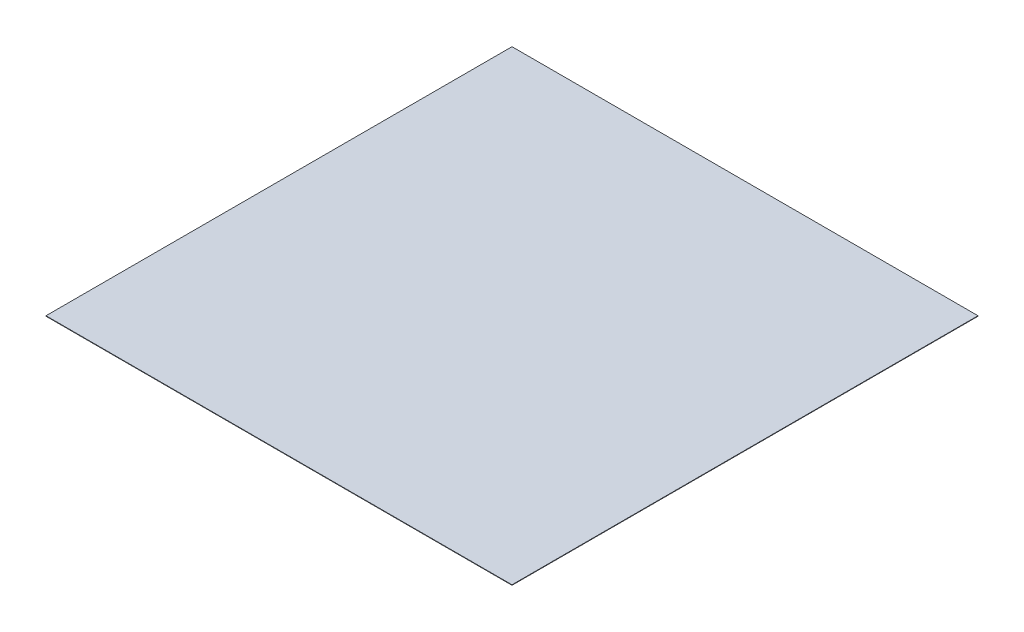
ISO-10303-21;
HEADER;
FILE_DESCRIPTION(('STEP AP214'),'2;1');
FILE_NAME('part.step','',(''),(''),'','','');
FILE_SCHEMA(('AUTOMOTIVE_DESIGN { 1 0 10303 214 1 1 1 1 }'));
ENDSEC;
DATA;
#1=APPLICATION_CONTEXT('core data for automotive mechanical design processes');
#2=APPLICATION_PROTOCOL_DEFINITION('international standard','automotive_design',2000,#1);
#3=PRODUCT_CONTEXT('',#1,'mechanical');
#4=PRODUCT('Part','Part','',(#3));
#5=PRODUCT_RELATED_PRODUCT_CATEGORY('part','',(#4));
#6=PRODUCT_DEFINITION_FORMATION('','',#4);
#7=PRODUCT_DEFINITION_CONTEXT('part definition',#1,'design');
#8=PRODUCT_DEFINITION('design','',#6,#7);
#9=PRODUCT_DEFINITION_SHAPE('','',#8);
#10=(LENGTH_UNIT() NAMED_UNIT(*) SI_UNIT(.MILLI.,.METRE.));
#11=(NAMED_UNIT(*) PLANE_ANGLE_UNIT() SI_UNIT($,.RADIAN.));
#12=(NAMED_UNIT(*) SI_UNIT($,.STERADIAN.) SOLID_ANGLE_UNIT());
#13=UNCERTAINTY_MEASURE_WITH_UNIT(LENGTH_MEASURE(1.E-05),#10,'distance_accuracy_value','');
#14=(GEOMETRIC_REPRESENTATION_CONTEXT(3) GLOBAL_UNCERTAINTY_ASSIGNED_CONTEXT((#13)) GLOBAL_UNIT_ASSIGNED_CONTEXT((#10,
#11,#12)) REPRESENTATION_CONTEXT('',''));
#15=CARTESIAN_POINT('',(0.,0.,0.));
#16=DIRECTION('',(0.,0.,1.));
#17=DIRECTION('',(1.,0.,0.));
#18=AXIS2_PLACEMENT_3D('',#15,#16,#17);
#19=CARTESIAN_POINT('',(500.,1.,500.));
#20=DIRECTION('',(-1.,0.,0.));
#21=DIRECTION('',(0.,0.,1.));
#22=AXIS2_PLACEMENT_3D('',#19,#20,#21);
#23=PLANE('',#22);
#24=DIRECTION('',(0.,0.,-1.));
#25=VECTOR('',#24,1.);
#26=CARTESIAN_POINT('',(500.,0.,500.));
#27=LINE('',#26,#25);
#28=CARTESIAN_POINT('',(500.,0.,500.));
#29=VERTEX_POINT('',#28);
#30=CARTESIAN_POINT('',(500.,0.,-500.));
#31=VERTEX_POINT('',#30);
#32=EDGE_CURVE('E98',#29,#31,#27,.T.);
#33=ORIENTED_EDGE('',*,*,#32,.T.);
#34=DIRECTION('',(0.,-1.,0.));
#35=VECTOR('',#34,1.);
#36=CARTESIAN_POINT('',(500.,1.,-500.));
#37=LINE('',#36,#35);
#38=CARTESIAN_POINT('',(500.,1.,-500.));
#39=VERTEX_POINT('',#38);
#40=EDGE_CURVE('E11',#39,#31,#37,.T.);
#41=ORIENTED_EDGE('',*,*,#40,.F.);
#42=DIRECTION('',(0.,0.,-1.));
#43=VECTOR('',#42,1.);
#44=CARTESIAN_POINT('',(500.,1.,500.));
#45=LINE('',#44,#43);
#46=CARTESIAN_POINT('',(500.,1.,500.));
#47=VERTEX_POINT('',#46);
#48=EDGE_CURVE('E86',#47,#39,#45,.T.);
#49=ORIENTED_EDGE('',*,*,#48,.F.);
#50=DIRECTION('',(0.,-1.,0.));
#51=VECTOR('',#50,1.);
#52=CARTESIAN_POINT('',(500.,1.,500.));
#53=LINE('',#52,#51);
#54=EDGE_CURVE('E94',#47,#29,#53,.T.);
#55=ORIENTED_EDGE('',*,*,#54,.T.);
#56=EDGE_LOOP('',(#33,#41,#49,#55));
#57=FACE_BOUND('',#56,.T.);
#58=ADVANCED_FACE('F35',(#57),#23,.F.);
#59=CARTESIAN_POINT('',(-500.,1.,-500.));
#60=DIRECTION('',(0.,0.,1.));
#61=DIRECTION('',(1.,0.,0.));
#62=AXIS2_PLACEMENT_3D('',#59,#60,#61);
#63=PLANE('',#62);
#64=DIRECTION('',(-1.,0.,0.));
#65=VECTOR('',#64,1.);
#66=CARTESIAN_POINT('',(-500.,0.,-500.));
#67=LINE('',#66,#65);
#68=CARTESIAN_POINT('',(-500.,0.,-500.));
#69=VERTEX_POINT('',#68);
#70=EDGE_CURVE('E90',#31,#69,#67,.T.);
#71=ORIENTED_EDGE('',*,*,#70,.T.);
#72=DIRECTION('',(0.,-1.,0.));
#73=VECTOR('',#72,1.);
#74=CARTESIAN_POINT('',(-500.,1.,-500.));
#75=LINE('',#74,#73);
#76=CARTESIAN_POINT('',(-500.,1.,-500.));
#77=VERTEX_POINT('',#76);
#78=EDGE_CURVE('E43',#77,#69,#75,.T.);
#79=ORIENTED_EDGE('',*,*,#78,.F.);
#80=DIRECTION('',(-1.,0.,0.));
#81=VECTOR('',#80,1.);
#82=CARTESIAN_POINT('',(-500.,1.,-500.));
#83=LINE('',#82,#81);
#84=EDGE_CURVE('E81',#39,#77,#83,.T.);
#85=ORIENTED_EDGE('',*,*,#84,.F.);
#86=ORIENTED_EDGE('',*,*,#40,.T.);
#87=EDGE_LOOP('',(#71,#79,#85,#86));
#88=FACE_BOUND('',#87,.T.);
#89=ADVANCED_FACE('F89',(#88),#63,.F.);
#90=CARTESIAN_POINT('',(-500.,1.,500.));
#91=DIRECTION('',(1.,0.,0.));
#92=DIRECTION('',(0.,0.,-1.));
#93=AXIS2_PLACEMENT_3D('',#90,#91,#92);
#94=PLANE('',#93);
#95=DIRECTION('',(0.,0.,1.));
#96=VECTOR('',#95,1.);
#97=CARTESIAN_POINT('',(-500.,0.,500.));
#98=LINE('',#97,#96);
#99=CARTESIAN_POINT('',(-500.,0.,500.));
#100=VERTEX_POINT('',#99);
#101=EDGE_CURVE('E68',#69,#100,#98,.T.);
#102=ORIENTED_EDGE('',*,*,#101,.T.);
#103=DIRECTION('',(0.,-1.,0.));
#104=VECTOR('',#103,1.);
#105=CARTESIAN_POINT('',(-500.,1.,500.));
#106=LINE('',#105,#104);
#107=CARTESIAN_POINT('',(-500.,1.,500.));
#108=VERTEX_POINT('',#107);
#109=EDGE_CURVE('E91',#108,#100,#106,.T.);
#110=ORIENTED_EDGE('',*,*,#109,.F.);
#111=DIRECTION('',(0.,0.,1.));
#112=VECTOR('',#111,1.);
#113=CARTESIAN_POINT('',(-500.,1.,500.));
#114=LINE('',#113,#112);
#115=EDGE_CURVE('E84',#77,#108,#114,.T.);
#116=ORIENTED_EDGE('',*,*,#115,.F.);
#117=ORIENTED_EDGE('',*,*,#78,.T.);
#118=EDGE_LOOP('',(#102,#110,#116,#117));
#119=FACE_BOUND('',#118,.T.);
#120=ADVANCED_FACE('F92',(#119),#94,.F.);
#121=CARTESIAN_POINT('',(-500.,1.,500.));
#122=DIRECTION('',(0.,0.,-1.));
#123=DIRECTION('',(-1.,0.,0.));
#124=AXIS2_PLACEMENT_3D('',#121,#122,#123);
#125=PLANE('',#124);
#126=DIRECTION('',(1.,0.,0.));
#127=VECTOR('',#126,1.);
#128=CARTESIAN_POINT('',(-500.,0.,500.));
#129=LINE('',#128,#127);
#130=EDGE_CURVE('E74',#100,#29,#129,.T.);
#131=ORIENTED_EDGE('',*,*,#130,.T.);
#132=ORIENTED_EDGE('',*,*,#54,.F.);
#133=DIRECTION('',(1.,0.,0.));
#134=VECTOR('',#133,1.);
#135=CARTESIAN_POINT('',(-500.,1.,500.));
#136=LINE('',#135,#134);
#137=EDGE_CURVE('E51',#108,#47,#136,.T.);
#138=ORIENTED_EDGE('',*,*,#137,.F.);
#139=ORIENTED_EDGE('',*,*,#109,.T.);
#140=EDGE_LOOP('',(#131,#132,#138,#139));
#141=FACE_BOUND('',#140,.T.);
#142=ADVANCED_FACE('F105',(#141),#125,.F.);
#143=CARTESIAN_POINT('',(0.,1.,0.));
#144=DIRECTION('',(0.,-1.,0.));
#145=DIRECTION('',(0.,0.,-1.));
#146=AXIS2_PLACEMENT_3D('',#143,#144,#145);
#147=PLANE('',#146);
#148=ORIENTED_EDGE('',*,*,#48,.T.);
#149=ORIENTED_EDGE('',*,*,#84,.T.);
#150=ORIENTED_EDGE('',*,*,#115,.T.);
#151=ORIENTED_EDGE('',*,*,#137,.T.);
#152=EDGE_LOOP('',(#148,#149,#150,#151));
#153=FACE_BOUND('',#152,.T.);
#154=ADVANCED_FACE('F82',(#153),#147,.F.);
#155=CARTESIAN_POINT('',(0.,0.,0.));
#156=DIRECTION('',(0.,-1.,0.));
#157=DIRECTION('',(0.,0.,-1.));
#158=AXIS2_PLACEMENT_3D('',#155,#156,#157);
#159=PLANE('',#158);
#160=ORIENTED_EDGE('',*,*,#32,.F.);
#161=ORIENTED_EDGE('',*,*,#130,.F.);
#162=ORIENTED_EDGE('',*,*,#101,.F.);
#163=ORIENTED_EDGE('',*,*,#70,.F.);
#164=EDGE_LOOP('',(#160,#161,#162,#163));
#165=FACE_BOUND('',#164,.T.);
#166=ADVANCED_FACE('F108',(#165),#159,.T.);
#167=CLOSED_SHELL('',(#58,#89,#120,#142,#154,#166));
#168=MANIFOLD_SOLID_BREP('B2',#167);
#169=ADVANCED_BREP_SHAPE_REPRESENTATION('',(#18,#168),#14);
#170=SHAPE_DEFINITION_REPRESENTATION(#9,#169);
ENDSEC;
END-ISO-10303-21;
